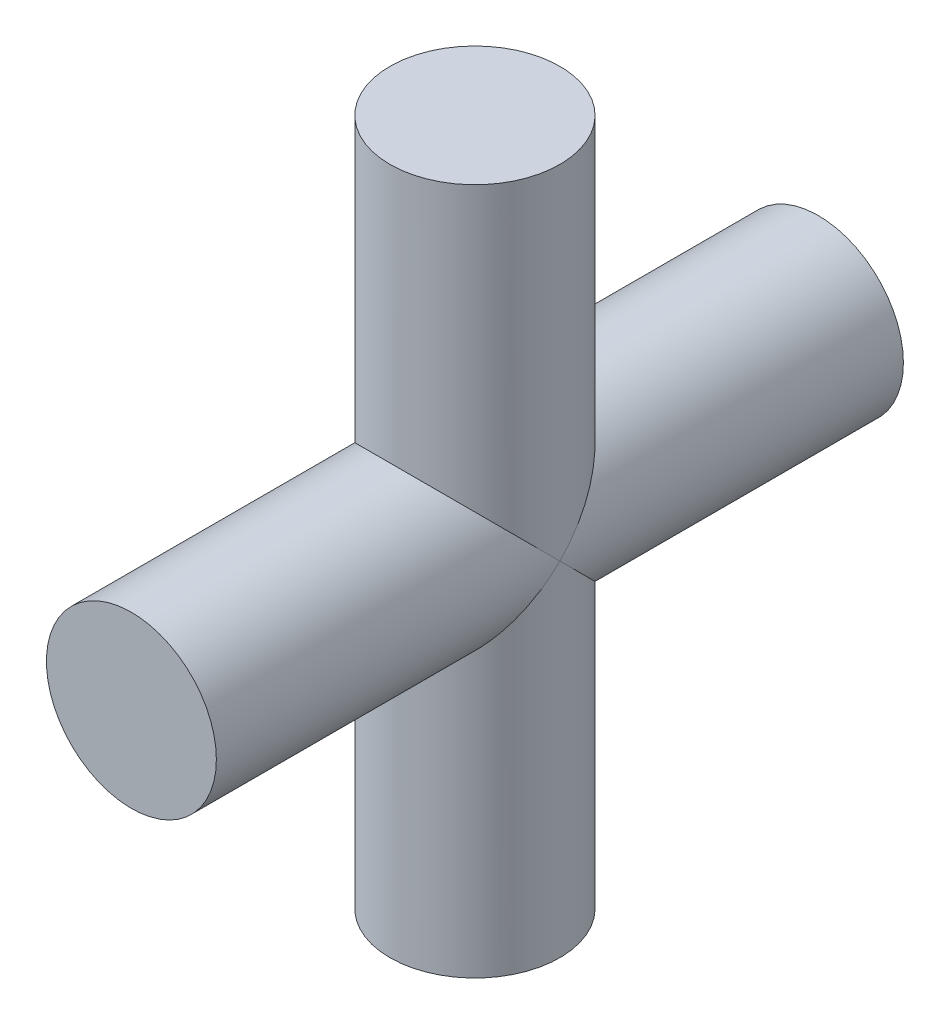
ISO-10303-21;
HEADER;
FILE_DESCRIPTION(('STEP AP214'),'2;1');
FILE_NAME('part.step','',(''),(''),'','','');
FILE_SCHEMA(('AUTOMOTIVE_DESIGN { 1 0 10303 214 1 1 1 1 }'));
ENDSEC;
DATA;
#1=APPLICATION_CONTEXT('core data for automotive mechanical design processes');
#2=APPLICATION_PROTOCOL_DEFINITION('international standard','automotive_design',2000,#1);
#3=PRODUCT_CONTEXT('',#1,'mechanical');
#4=PRODUCT('Part','Part','',(#3));
#5=PRODUCT_RELATED_PRODUCT_CATEGORY('part','',(#4));
#6=PRODUCT_DEFINITION_FORMATION('','',#4);
#7=PRODUCT_DEFINITION_CONTEXT('part definition',#1,'design');
#8=PRODUCT_DEFINITION('design','',#6,#7);
#9=PRODUCT_DEFINITION_SHAPE('','',#8);
#10=(LENGTH_UNIT() NAMED_UNIT(*) SI_UNIT(.MILLI.,.METRE.));
#11=(NAMED_UNIT(*) PLANE_ANGLE_UNIT() SI_UNIT($,.RADIAN.));
#12=(NAMED_UNIT(*) SI_UNIT($,.STERADIAN.) SOLID_ANGLE_UNIT());
#13=UNCERTAINTY_MEASURE_WITH_UNIT(LENGTH_MEASURE(1.E-05),#10,'distance_accuracy_value','');
#14=(GEOMETRIC_REPRESENTATION_CONTEXT(3) GLOBAL_UNCERTAINTY_ASSIGNED_CONTEXT((#13)) GLOBAL_UNIT_ASSIGNED_CONTEXT((#10,
#11,#12)) REPRESENTATION_CONTEXT('',''));
#15=CARTESIAN_POINT('',(0.,0.,0.));
#16=DIRECTION('',(0.,0.,1.));
#17=DIRECTION('',(1.,0.,0.));
#18=AXIS2_PLACEMENT_3D('',#15,#16,#17);
#19=CARTESIAN_POINT('',(0.,0.,-19.));
#20=DIRECTION('',(0.,0.,1.));
#21=DIRECTION('',(1.,0.,0.));
#22=AXIS2_PLACEMENT_3D('',#19,#20,#21);
#23=CYLINDRICAL_SURFACE('',#22,4.7);
#24=CARTESIAN_POINT('',(0.,0.,0.));
#25=DIRECTION('',(0.,0.707106781186547,0.707106781186547));
#26=DIRECTION('',(0.,-0.707106781186547,0.707106781186547));
#27=AXIS2_PLACEMENT_3D('',#24,#25,#26);
#28=ELLIPSE('',#27,6.64680374315355,4.7);
#29=CARTESIAN_POINT('',(4.7,0.,0.));
#30=VERTEX_POINT('',#29);
#31=CARTESIAN_POINT('',(-4.7,0.,0.));
#32=VERTEX_POINT('',#31);
#33=EDGE_CURVE('E40',#30,#32,#28,.T.);
#34=ORIENTED_EDGE('',*,*,#33,.F.);
#35=CARTESIAN_POINT('',(0.,0.,0.));
#36=DIRECTION('',(0.,-0.707106781186547,0.707106781186547));
#37=DIRECTION('',(0.,0.707106781186547,0.707106781186547));
#38=AXIS2_PLACEMENT_3D('',#35,#36,#37);
#39=ELLIPSE('',#38,6.64680374315355,4.7);
#40=EDGE_CURVE('E52',#32,#30,#39,.T.);
#41=ORIENTED_EDGE('',*,*,#40,.F.);
#42=EDGE_LOOP('',(#34,#41));
#43=FACE_BOUND('',#42,.T.);
#44=CARTESIAN_POINT('',(0.,0.,-19.));
#45=DIRECTION('',(0.,0.,1.));
#46=DIRECTION('',(1.,0.,0.));
#47=AXIS2_PLACEMENT_3D('',#44,#45,#46);
#48=CIRCLE('',#47,4.7);
#49=CARTESIAN_POINT('',(4.7,0.,-19.));
#50=VERTEX_POINT('',#49);
#51=EDGE_CURVE('E59',#50,#50,#48,.T.);
#52=ORIENTED_EDGE('',*,*,#51,.T.);
#53=EDGE_LOOP('',(#52));
#54=FACE_BOUND('',#53,.T.);
#55=ADVANCED_FACE('F33',(#43,#54),#23,.T.);
#56=CARTESIAN_POINT('',(0.,0.,-19.));
#57=DIRECTION('',(0.,0.,1.));
#58=DIRECTION('',(1.,0.,0.));
#59=AXIS2_PLACEMENT_3D('',#56,#57,#58);
#60=PLANE('',#59);
#61=ORIENTED_EDGE('',*,*,#51,.F.);
#62=EDGE_LOOP('',(#61));
#63=FACE_BOUND('',#62,.T.);
#64=ADVANCED_FACE('F82',(#63),#60,.F.);
#65=CARTESIAN_POINT('',(0.,19.,0.));
#66=DIRECTION('',(0.,1.,0.));
#67=DIRECTION('',(0.,0.,1.));
#68=AXIS2_PLACEMENT_3D('',#65,#66,#67);
#69=PLANE('',#68);
#70=CARTESIAN_POINT('',(0.,19.,0.));
#71=DIRECTION('',(0.,1.,0.));
#72=DIRECTION('',(0.,0.,1.));
#73=AXIS2_PLACEMENT_3D('',#70,#71,#72);
#74=CIRCLE('',#73,4.7);
#75=CARTESIAN_POINT('',(0.,19.,4.7));
#76=VERTEX_POINT('',#75);
#77=EDGE_CURVE('E72',#76,#76,#74,.T.);
#78=ORIENTED_EDGE('',*,*,#77,.T.);
#79=EDGE_LOOP('',(#78));
#80=FACE_BOUND('',#79,.T.);
#81=ADVANCED_FACE('F84',(#80),#69,.T.);
#82=CARTESIAN_POINT('',(0.,-19.,0.));
#83=DIRECTION('',(0.,1.,0.));
#84=DIRECTION('',(0.,0.,1.));
#85=AXIS2_PLACEMENT_3D('',#82,#83,#84);
#86=CYLINDRICAL_SURFACE('',#85,4.7);
#87=ORIENTED_EDGE('',*,*,#77,.F.);
#88=EDGE_LOOP('',(#87));
#89=FACE_BOUND('',#88,.T.);
#90=CARTESIAN_POINT('',(0.,0.,0.));
#91=DIRECTION('',(0.,-0.707106781186547,0.707106781186547));
#92=DIRECTION('',(0.,0.707106781186547,0.707106781186547));
#93=AXIS2_PLACEMENT_3D('',#90,#91,#92);
#94=ELLIPSE('',#93,6.64680374315355,4.7);
#95=EDGE_CURVE('E46',#32,#30,#94,.F.);
#96=ORIENTED_EDGE('',*,*,#95,.T.);
#97=ORIENTED_EDGE('',*,*,#33,.T.);
#98=EDGE_LOOP('',(#96,#97));
#99=FACE_BOUND('',#98,.T.);
#100=ADVANCED_FACE('F61',(#89,#99),#86,.T.);
#101=CARTESIAN_POINT('',(0.,0.,19.));
#102=DIRECTION('',(0.,0.,1.));
#103=DIRECTION('',(1.,0.,0.));
#104=AXIS2_PLACEMENT_3D('',#101,#102,#103);
#105=PLANE('',#104);
#106=CARTESIAN_POINT('',(0.,0.,19.));
#107=DIRECTION('',(0.,0.,1.));
#108=DIRECTION('',(1.,0.,0.));
#109=AXIS2_PLACEMENT_3D('',#106,#107,#108);
#110=CIRCLE('',#109,4.7);
#111=CARTESIAN_POINT('',(4.7,0.,19.));
#112=VERTEX_POINT('',#111);
#113=EDGE_CURVE('E71',#112,#112,#110,.T.);
#114=ORIENTED_EDGE('',*,*,#113,.T.);
#115=EDGE_LOOP('',(#114));
#116=FACE_BOUND('',#115,.T.);
#117=ADVANCED_FACE('F92',(#116),#105,.T.);
#118=CARTESIAN_POINT('',(0.,0.,0.));
#119=DIRECTION('',(0.,0.707106781186547,0.707106781186547));
#120=DIRECTION('',(0.,-0.707106781186547,0.707106781186547));
#121=AXIS2_PLACEMENT_3D('',#118,#119,#120);
#122=ELLIPSE('',#121,6.64680374315355,4.7);
#123=EDGE_CURVE('E11',#30,#32,#122,.F.);
#124=ORIENTED_EDGE('',*,*,#123,.F.);
#125=ORIENTED_EDGE('',*,*,#95,.F.);
#126=EDGE_LOOP('',(#124,#125));
#127=FACE_BOUND('',#126,.T.);
#128=ORIENTED_EDGE('',*,*,#113,.F.);
#129=EDGE_LOOP('',(#128));
#130=FACE_BOUND('',#129,.T.);
#131=ADVANCED_FACE('F57',(#127,#130),#23,.T.);
#132=ORIENTED_EDGE('',*,*,#40,.T.);
#133=ORIENTED_EDGE('',*,*,#123,.T.);
#134=EDGE_LOOP('',(#132,#133));
#135=FACE_BOUND('',#134,.T.);
#136=CARTESIAN_POINT('',(0.,-19.,0.));
#137=DIRECTION('',(0.,1.,0.));
#138=DIRECTION('',(0.,0.,1.));
#139=AXIS2_PLACEMENT_3D('',#136,#137,#138);
#140=CIRCLE('',#139,4.7);
#141=CARTESIAN_POINT('',(0.,-19.,4.7));
#142=VERTEX_POINT('',#141);
#143=EDGE_CURVE('E69',#142,#142,#140,.T.);
#144=ORIENTED_EDGE('',*,*,#143,.T.);
#145=EDGE_LOOP('',(#144));
#146=FACE_BOUND('',#145,.T.);
#147=ADVANCED_FACE('F62',(#135,#146),#86,.T.);
#148=CARTESIAN_POINT('',(0.,-19.,0.));
#149=DIRECTION('',(0.,1.,0.));
#150=DIRECTION('',(0.,0.,1.));
#151=AXIS2_PLACEMENT_3D('',#148,#149,#150);
#152=PLANE('',#151);
#153=ORIENTED_EDGE('',*,*,#143,.F.);
#154=EDGE_LOOP('',(#153));
#155=FACE_BOUND('',#154,.T.);
#156=ADVANCED_FACE('F65',(#155),#152,.F.);
#157=CLOSED_SHELL('',(#55,#64,#81,#100,#117,#131,#147,#156));
#158=MANIFOLD_SOLID_BREP('B2',#157);
#159=ADVANCED_BREP_SHAPE_REPRESENTATION('',(#18,#158),#14);
#160=SHAPE_DEFINITION_REPRESENTATION(#9,#159);
ENDSEC;
END-ISO-10303-21;
